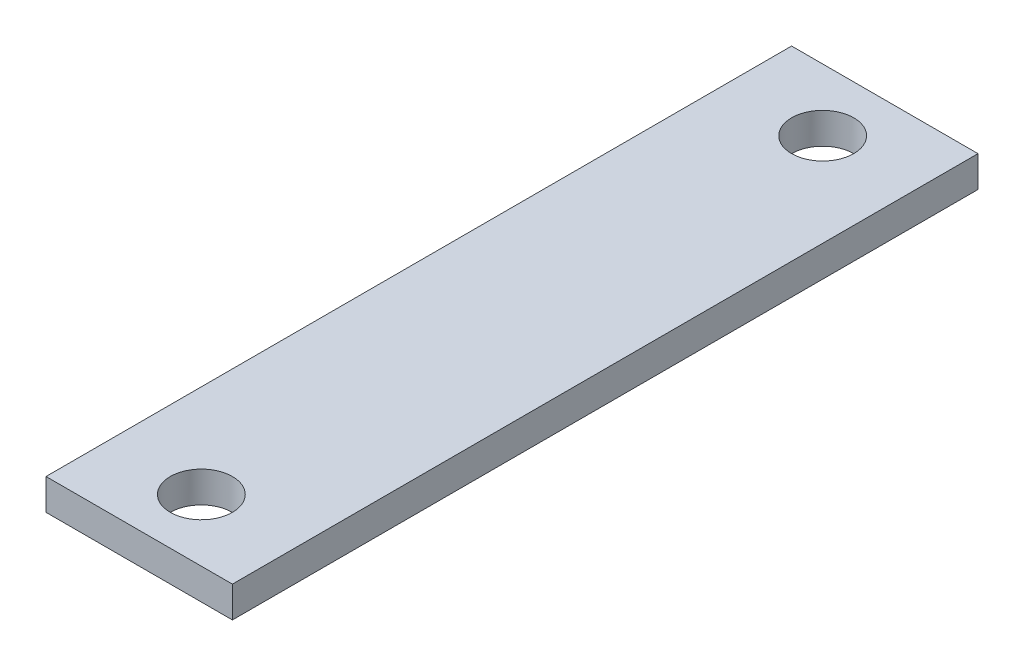
ISO-10303-21;
HEADER;
FILE_DESCRIPTION(('STEP AP214'),'2;1');
FILE_NAME('part.step','',(''),(''),'','','');
FILE_SCHEMA(('AUTOMOTIVE_DESIGN { 1 0 10303 214 1 1 1 1 }'));
ENDSEC;
DATA;
#1=APPLICATION_CONTEXT('core data for automotive mechanical design processes');
#2=APPLICATION_PROTOCOL_DEFINITION('international standard','automotive_design',2000,#1);
#3=PRODUCT_CONTEXT('',#1,'mechanical');
#4=PRODUCT('Part','Part','',(#3));
#5=PRODUCT_RELATED_PRODUCT_CATEGORY('part','',(#4));
#6=PRODUCT_DEFINITION_FORMATION('','',#4);
#7=PRODUCT_DEFINITION_CONTEXT('part definition',#1,'design');
#8=PRODUCT_DEFINITION('design','',#6,#7);
#9=PRODUCT_DEFINITION_SHAPE('','',#8);
#10=(LENGTH_UNIT() NAMED_UNIT(*) SI_UNIT(.MILLI.,.METRE.));
#11=(NAMED_UNIT(*) PLANE_ANGLE_UNIT() SI_UNIT($,.RADIAN.));
#12=(NAMED_UNIT(*) SI_UNIT($,.STERADIAN.) SOLID_ANGLE_UNIT());
#13=UNCERTAINTY_MEASURE_WITH_UNIT(LENGTH_MEASURE(1.E-05),#10,'distance_accuracy_value','');
#14=(GEOMETRIC_REPRESENTATION_CONTEXT(3) GLOBAL_UNCERTAINTY_ASSIGNED_CONTEXT((#13)) GLOBAL_UNIT_ASSIGNED_CONTEXT((#10,
#11,#12)) REPRESENTATION_CONTEXT('',''));
#15=CARTESIAN_POINT('',(0.,0.,0.));
#16=DIRECTION('',(0.,0.,1.));
#17=DIRECTION('',(1.,0.,0.));
#18=AXIS2_PLACEMENT_3D('',#15,#16,#17);
#19=CARTESIAN_POINT('',(1.5,0.5,3.23181818181818));
#20=DIRECTION('',(-1.,0.,0.));
#21=DIRECTION('',(0.,0.,1.));
#22=AXIS2_PLACEMENT_3D('',#19,#20,#21);
#23=PLANE('',#22);
#24=DIRECTION('',(0.,0.,-1.));
#25=VECTOR('',#24,1.);
#26=CARTESIAN_POINT('',(1.5,0.,3.23181818181818));
#27=LINE('',#26,#25);
#28=CARTESIAN_POINT('',(1.5,0.,3.23181818181818));
#29=VERTEX_POINT('',#28);
#30=CARTESIAN_POINT('',(1.5,0.,-8.76818181818182));
#31=VERTEX_POINT('',#30);
#32=EDGE_CURVE('E113',#29,#31,#27,.T.);
#33=ORIENTED_EDGE('',*,*,#32,.T.);
#34=DIRECTION('',(0.,-1.,0.));
#35=VECTOR('',#34,1.);
#36=CARTESIAN_POINT('',(1.5,0.5,-8.76818181818182));
#37=LINE('',#36,#35);
#38=CARTESIAN_POINT('',(1.5,0.5,-8.76818181818182));
#39=VERTEX_POINT('',#38);
#40=EDGE_CURVE('E11',#39,#31,#37,.T.);
#41=ORIENTED_EDGE('',*,*,#40,.F.);
#42=DIRECTION('',(0.,0.,-1.));
#43=VECTOR('',#42,1.);
#44=CARTESIAN_POINT('',(1.5,0.5,3.23181818181818));
#45=LINE('',#44,#43);
#46=CARTESIAN_POINT('',(1.5,0.5,3.23181818181818));
#47=VERTEX_POINT('',#46);
#48=EDGE_CURVE('E96',#47,#39,#45,.T.);
#49=ORIENTED_EDGE('',*,*,#48,.F.);
#50=DIRECTION('',(0.,-1.,0.));
#51=VECTOR('',#50,1.);
#52=CARTESIAN_POINT('',(1.5,0.5,3.23181818181818));
#53=LINE('',#52,#51);
#54=EDGE_CURVE('E109',#47,#29,#53,.T.);
#55=ORIENTED_EDGE('',*,*,#54,.T.);
#56=EDGE_LOOP('',(#33,#41,#49,#55));
#57=FACE_BOUND('',#56,.T.);
#58=ADVANCED_FACE('F42',(#57),#23,.F.);
#59=CARTESIAN_POINT('',(-1.5,0.5,-8.76818181818182));
#60=DIRECTION('',(0.,0.,1.));
#61=DIRECTION('',(1.,0.,0.));
#62=AXIS2_PLACEMENT_3D('',#59,#60,#61);
#63=PLANE('',#62);
#64=DIRECTION('',(-1.,0.,0.));
#65=VECTOR('',#64,1.);
#66=CARTESIAN_POINT('',(-1.5,0.,-8.76818181818182));
#67=LINE('',#66,#65);
#68=CARTESIAN_POINT('',(-1.5,0.,-8.76818181818182));
#69=VERTEX_POINT('',#68);
#70=EDGE_CURVE('E101',#31,#69,#67,.T.);
#71=ORIENTED_EDGE('',*,*,#70,.T.);
#72=DIRECTION('',(0.,-1.,0.));
#73=VECTOR('',#72,1.);
#74=CARTESIAN_POINT('',(-1.5,0.5,-8.76818181818182));
#75=LINE('',#74,#73);
#76=CARTESIAN_POINT('',(-1.5,0.5,-8.76818181818182));
#77=VERTEX_POINT('',#76);
#78=EDGE_CURVE('E52',#77,#69,#75,.T.);
#79=ORIENTED_EDGE('',*,*,#78,.F.);
#80=DIRECTION('',(-1.,0.,0.));
#81=VECTOR('',#80,1.);
#82=CARTESIAN_POINT('',(-1.5,0.5,-8.76818181818182));
#83=LINE('',#82,#81);
#84=EDGE_CURVE('E91',#39,#77,#83,.T.);
#85=ORIENTED_EDGE('',*,*,#84,.F.);
#86=ORIENTED_EDGE('',*,*,#40,.T.);
#87=EDGE_LOOP('',(#71,#79,#85,#86));
#88=FACE_BOUND('',#87,.T.);
#89=ADVANCED_FACE('F100',(#88),#63,.F.);
#90=CARTESIAN_POINT('',(-1.5,0.5,3.23181818181818));
#91=DIRECTION('',(1.,0.,0.));
#92=DIRECTION('',(0.,0.,-1.));
#93=AXIS2_PLACEMENT_3D('',#90,#91,#92);
#94=PLANE('',#93);
#95=DIRECTION('',(0.,0.,1.));
#96=VECTOR('',#95,1.);
#97=CARTESIAN_POINT('',(-1.5,0.,3.23181818181818));
#98=LINE('',#97,#96);
#99=CARTESIAN_POINT('',(-1.5,0.,3.23181818181818));
#100=VERTEX_POINT('',#99);
#101=EDGE_CURVE('E78',#69,#100,#98,.T.);
#102=ORIENTED_EDGE('',*,*,#101,.T.);
#103=DIRECTION('',(0.,-1.,0.));
#104=VECTOR('',#103,1.);
#105=CARTESIAN_POINT('',(-1.5,0.5,3.23181818181818));
#106=LINE('',#105,#104);
#107=CARTESIAN_POINT('',(-1.5,0.5,3.23181818181818));
#108=VERTEX_POINT('',#107);
#109=EDGE_CURVE('E103',#108,#100,#106,.T.);
#110=ORIENTED_EDGE('',*,*,#109,.F.);
#111=DIRECTION('',(0.,0.,1.));
#112=VECTOR('',#111,1.);
#113=CARTESIAN_POINT('',(-1.5,0.5,3.23181818181818));
#114=LINE('',#113,#112);
#115=EDGE_CURVE('E94',#77,#108,#114,.T.);
#116=ORIENTED_EDGE('',*,*,#115,.F.);
#117=ORIENTED_EDGE('',*,*,#78,.T.);
#118=EDGE_LOOP('',(#102,#110,#116,#117));
#119=FACE_BOUND('',#118,.T.);
#120=ADVANCED_FACE('F105',(#119),#94,.F.);
#121=CARTESIAN_POINT('',(-1.5,0.5,3.23181818181818));
#122=DIRECTION('',(0.,0.,-1.));
#123=DIRECTION('',(-1.,0.,0.));
#124=AXIS2_PLACEMENT_3D('',#121,#122,#123);
#125=PLANE('',#124);
#126=DIRECTION('',(1.,0.,0.));
#127=VECTOR('',#126,1.);
#128=CARTESIAN_POINT('',(-1.5,0.,3.23181818181818));
#129=LINE('',#128,#127);
#130=EDGE_CURVE('E84',#100,#29,#129,.T.);
#131=ORIENTED_EDGE('',*,*,#130,.T.);
#132=ORIENTED_EDGE('',*,*,#54,.F.);
#133=DIRECTION('',(1.,0.,0.));
#134=VECTOR('',#133,1.);
#135=CARTESIAN_POINT('',(-1.5,0.5,3.23181818181818));
#136=LINE('',#135,#134);
#137=EDGE_CURVE('E61',#108,#47,#136,.T.);
#138=ORIENTED_EDGE('',*,*,#137,.F.);
#139=ORIENTED_EDGE('',*,*,#109,.T.);
#140=EDGE_LOOP('',(#131,#132,#138,#139));
#141=FACE_BOUND('',#140,.T.);
#142=ADVANCED_FACE('F150',(#141),#125,.F.);
#143=CARTESIAN_POINT('',(0.,0.5,0.));
#144=DIRECTION('',(0.,-1.,0.));
#145=DIRECTION('',(0.,0.,-1.));
#146=AXIS2_PLACEMENT_3D('',#143,#144,#145);
#147=PLANE('',#146);
#148=CARTESIAN_POINT('',(0.,0.5,-7.76818181818182));
#149=DIRECTION('',(0.,1.,0.));
#150=DIRECTION('',(0.,0.,1.));
#151=AXIS2_PLACEMENT_3D('',#148,#149,#150);
#152=CIRCLE('',#151,0.5);
#153=CARTESIAN_POINT('',(0.,0.5,-7.26818181818182));
#154=VERTEX_POINT('',#153);
#155=EDGE_CURVE('E129',#154,#154,#152,.T.);
#156=ORIENTED_EDGE('',*,*,#155,.F.);
#157=EDGE_LOOP('',(#156));
#158=FACE_BOUND('',#157,.T.);
#159=CARTESIAN_POINT('',(0.,0.5,2.23181818181818));
#160=DIRECTION('',(0.,1.,0.));
#161=DIRECTION('',(0.,0.,1.));
#162=AXIS2_PLACEMENT_3D('',#159,#160,#161);
#163=CIRCLE('',#162,0.5);
#164=CARTESIAN_POINT('',(0.,0.5,2.73181818181818));
#165=VERTEX_POINT('',#164);
#166=EDGE_CURVE('E136',#165,#165,#163,.T.);
#167=ORIENTED_EDGE('',*,*,#166,.F.);
#168=EDGE_LOOP('',(#167));
#169=FACE_BOUND('',#168,.T.);
#170=ORIENTED_EDGE('',*,*,#48,.T.);
#171=ORIENTED_EDGE('',*,*,#84,.T.);
#172=ORIENTED_EDGE('',*,*,#115,.T.);
#173=ORIENTED_EDGE('',*,*,#137,.T.);
#174=EDGE_LOOP('',(#170,#171,#172,#173));
#175=FACE_BOUND('',#174,.T.);
#176=ADVANCED_FACE('F92',(#158,#169,#175),#147,.F.);
#177=CARTESIAN_POINT('',(0.,0.,0.));
#178=DIRECTION('',(0.,-1.,0.));
#179=DIRECTION('',(0.,0.,-1.));
#180=AXIS2_PLACEMENT_3D('',#177,#178,#179);
#181=PLANE('',#180);
#182=CARTESIAN_POINT('',(0.,0.,-7.76818181818182));
#183=DIRECTION('',(0.,-1.,0.));
#184=DIRECTION('',(0.,0.,-1.));
#185=AXIS2_PLACEMENT_3D('',#182,#183,#184);
#186=CIRCLE('',#185,0.5);
#187=CARTESIAN_POINT('',(0.,0.,-8.26818181818182));
#188=VERTEX_POINT('',#187);
#189=EDGE_CURVE('E45',#188,#188,#186,.T.);
#190=ORIENTED_EDGE('',*,*,#189,.F.);
#191=EDGE_LOOP('',(#190));
#192=FACE_BOUND('',#191,.T.);
#193=CARTESIAN_POINT('',(0.,0.,2.23181818181818));
#194=DIRECTION('',(0.,-1.,0.));
#195=DIRECTION('',(0.,0.,-1.));
#196=AXIS2_PLACEMENT_3D('',#193,#194,#195);
#197=CIRCLE('',#196,0.5);
#198=CARTESIAN_POINT('',(0.,0.,1.73181818181818));
#199=VERTEX_POINT('',#198);
#200=EDGE_CURVE('E126',#199,#199,#197,.T.);
#201=ORIENTED_EDGE('',*,*,#200,.F.);
#202=EDGE_LOOP('',(#201));
#203=FACE_BOUND('',#202,.T.);
#204=ORIENTED_EDGE('',*,*,#32,.F.);
#205=ORIENTED_EDGE('',*,*,#130,.F.);
#206=ORIENTED_EDGE('',*,*,#101,.F.);
#207=ORIENTED_EDGE('',*,*,#70,.F.);
#208=EDGE_LOOP('',(#204,#205,#206,#207));
#209=FACE_BOUND('',#208,.T.);
#210=ADVANCED_FACE('F149',(#192,#203,#209),#181,.T.);
#211=CARTESIAN_POINT('',(0.,-0.5,2.23181818181818));
#212=DIRECTION('',(0.,1.,0.));
#213=DIRECTION('',(0.,0.,1.));
#214=AXIS2_PLACEMENT_3D('',#211,#212,#213);
#215=CYLINDRICAL_SURFACE('',#214,0.5);
#216=ORIENTED_EDGE('',*,*,#200,.T.);
#217=EDGE_LOOP('',(#216));
#218=FACE_BOUND('',#217,.T.);
#219=ORIENTED_EDGE('',*,*,#166,.T.);
#220=EDGE_LOOP('',(#219));
#221=FACE_BOUND('',#220,.T.);
#222=ADVANCED_FACE('F146',(#218,#221),#215,.F.);
#223=CARTESIAN_POINT('',(0.,-0.5,-7.76818181818182));
#224=DIRECTION('',(0.,1.,0.));
#225=DIRECTION('',(0.,0.,1.));
#226=AXIS2_PLACEMENT_3D('',#223,#224,#225);
#227=CYLINDRICAL_SURFACE('',#226,0.5);
#228=ORIENTED_EDGE('',*,*,#189,.T.);
#229=EDGE_LOOP('',(#228));
#230=FACE_BOUND('',#229,.T.);
#231=ORIENTED_EDGE('',*,*,#155,.T.);
#232=EDGE_LOOP('',(#231));
#233=FACE_BOUND('',#232,.T.);
#234=ADVANCED_FACE('F200',(#230,#233),#227,.F.);
#235=CLOSED_SHELL('',(#58,#89,#120,#142,#176,#210,#222,#234));
#236=MANIFOLD_SOLID_BREP('B2',#235);
#237=ADVANCED_BREP_SHAPE_REPRESENTATION('',(#18,#236),#14);
#238=SHAPE_DEFINITION_REPRESENTATION(#9,#237);
ENDSEC;
END-ISO-10303-21;
